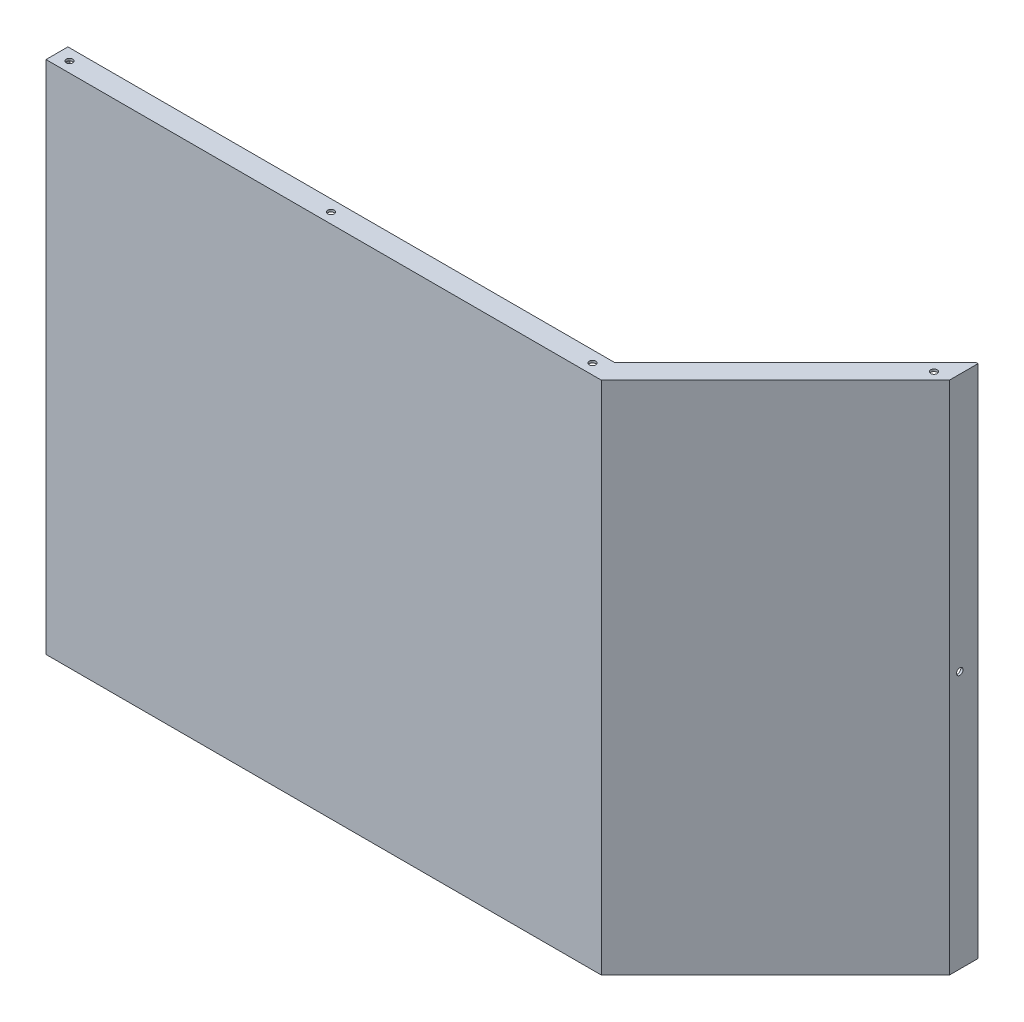
ISO-10303-21;
HEADER;
FILE_DESCRIPTION(('STEP AP214'),'2;1');
FILE_NAME('part.step','',(''),(''),'','','');
FILE_SCHEMA(('AUTOMOTIVE_DESIGN { 1 0 10303 214 1 1 1 1 }'));
ENDSEC;
DATA;
#1=APPLICATION_CONTEXT('core data for automotive mechanical design processes');
#2=APPLICATION_PROTOCOL_DEFINITION('international standard','automotive_design',2000,#1);
#3=PRODUCT_CONTEXT('',#1,'mechanical');
#4=PRODUCT('Part','Part','',(#3));
#5=PRODUCT_RELATED_PRODUCT_CATEGORY('part','',(#4));
#6=PRODUCT_DEFINITION_FORMATION('','',#4);
#7=PRODUCT_DEFINITION_CONTEXT('part definition',#1,'design');
#8=PRODUCT_DEFINITION('design','',#6,#7);
#9=PRODUCT_DEFINITION_SHAPE('','',#8);
#10=(LENGTH_UNIT() NAMED_UNIT(*) SI_UNIT(.MILLI.,.METRE.));
#11=(NAMED_UNIT(*) PLANE_ANGLE_UNIT() SI_UNIT($,.RADIAN.));
#12=(NAMED_UNIT(*) SI_UNIT($,.STERADIAN.) SOLID_ANGLE_UNIT());
#13=UNCERTAINTY_MEASURE_WITH_UNIT(LENGTH_MEASURE(1.E-05),#10,'distance_accuracy_value','');
#14=(GEOMETRIC_REPRESENTATION_CONTEXT(3) GLOBAL_UNCERTAINTY_ASSIGNED_CONTEXT((#13)) GLOBAL_UNIT_ASSIGNED_CONTEXT((#10,
#11,#12)) REPRESENTATION_CONTEXT('',''));
#15=CARTESIAN_POINT('',(0.,0.,0.));
#16=DIRECTION('',(0.,0.,1.));
#17=DIRECTION('',(1.,0.,0.));
#18=AXIS2_PLACEMENT_3D('',#15,#16,#17);
#19=CARTESIAN_POINT('',(-424.,197.,0.));
#20=DIRECTION('',(1.,0.,0.));
#21=DIRECTION('',(0.,0.,-1.));
#22=AXIS2_PLACEMENT_3D('',#19,#20,#21);
#23=PLANE('',#22);
#24=CARTESIAN_POINT('',(-424.,0.,-6.25));
#25=DIRECTION('',(-1.,0.,0.));
#26=DIRECTION('',(0.,0.,1.));
#27=AXIS2_PLACEMENT_3D('',#24,#25,#26);
#28=CIRCLE('',#27,2.5);
#29=CARTESIAN_POINT('',(-424.,0.,-3.75));
#30=VERTEX_POINT('',#29);
#31=EDGE_CURVE('E228',#30,#30,#28,.T.);
#32=ORIENTED_EDGE('',*,*,#31,.F.);
#33=EDGE_LOOP('',(#32));
#34=FACE_BOUND('',#33,.T.);
#35=DIRECTION('',(0.,0.,1.));
#36=VECTOR('',#35,1.);
#37=CARTESIAN_POINT('',(-424.,-197.,0.));
#38=LINE('',#37,#36);
#39=CARTESIAN_POINT('',(-424.,-197.,-15.));
#40=VERTEX_POINT('',#39);
#41=CARTESIAN_POINT('',(-424.,-197.,1.75));
#42=VERTEX_POINT('',#41);
#43=EDGE_CURVE('E299',#40,#42,#38,.T.);
#44=ORIENTED_EDGE('',*,*,#43,.T.);
#45=DIRECTION('',(0.,-1.,0.));
#46=VECTOR('',#45,1.);
#47=CARTESIAN_POINT('',(-424.,197.,1.75));
#48=LINE('',#47,#46);
#49=CARTESIAN_POINT('',(-424.,197.,1.75));
#50=VERTEX_POINT('',#49);
#51=EDGE_CURVE('E11',#50,#42,#48,.T.);
#52=ORIENTED_EDGE('',*,*,#51,.F.);
#53=DIRECTION('',(0.,0.,1.));
#54=VECTOR('',#53,1.);
#55=CARTESIAN_POINT('',(-424.,197.,0.));
#56=LINE('',#55,#54);
#57=CARTESIAN_POINT('',(-424.,197.,-15.));
#58=VERTEX_POINT('',#57);
#59=EDGE_CURVE('E300',#58,#50,#56,.T.);
#60=ORIENTED_EDGE('',*,*,#59,.F.);
#61=DIRECTION('',(0.,-1.,0.));
#62=VECTOR('',#61,1.);
#63=CARTESIAN_POINT('',(-424.,197.,-15.));
#64=LINE('',#63,#62);
#65=EDGE_CURVE('E174',#58,#40,#64,.T.);
#66=ORIENTED_EDGE('',*,*,#65,.T.);
#67=EDGE_LOOP('',(#44,#52,#60,#66));
#68=FACE_BOUND('',#67,.T.);
#69=ADVANCED_FACE('F37',(#34,#68),#23,.F.);
#70=CARTESIAN_POINT('',(-424.,197.,1.75));
#71=DIRECTION('',(0.,0.,-1.));
#72=DIRECTION('',(-1.,0.,0.));
#73=AXIS2_PLACEMENT_3D('',#70,#71,#72);
#74=PLANE('',#73);
#75=DIRECTION('',(1.,0.,0.));
#76=VECTOR('',#75,1.);
#77=CARTESIAN_POINT('',(-424.,-197.,1.75));
#78=LINE('',#77,#76);
#79=CARTESIAN_POINT('',(0.724873734152892,-197.,1.75));
#80=VERTEX_POINT('',#79);
#81=EDGE_CURVE('E314',#42,#80,#78,.T.);
#82=ORIENTED_EDGE('',*,*,#81,.T.);
#83=DIRECTION('',(0.,-1.,0.));
#84=VECTOR('',#83,1.);
#85=CARTESIAN_POINT('',(0.724873734152892,197.,1.75));
#86=LINE('',#85,#84);
#87=CARTESIAN_POINT('',(0.724873734152892,197.,1.75));
#88=VERTEX_POINT('',#87);
#89=EDGE_CURVE('E45',#88,#80,#86,.T.);
#90=ORIENTED_EDGE('',*,*,#89,.F.);
#91=DIRECTION('',(1.,0.,0.));
#92=VECTOR('',#91,1.);
#93=CARTESIAN_POINT('',(-424.,197.,1.75));
#94=LINE('',#93,#92);
#95=EDGE_CURVE('E302',#50,#88,#94,.T.);
#96=ORIENTED_EDGE('',*,*,#95,.F.);
#97=ORIENTED_EDGE('',*,*,#51,.T.);
#98=EDGE_LOOP('',(#82,#90,#96,#97));
#99=FACE_BOUND('',#98,.T.);
#100=ADVANCED_FACE('F370',(#99),#74,.F.);
#101=CARTESIAN_POINT('',(133.75,197.,-131.275126265848));
#102=DIRECTION('',(-0.707106781186549,0.,-0.707106781186546));
#103=DIRECTION('',(-0.707106781186546,0.,0.707106781186549));
#104=AXIS2_PLACEMENT_3D('',#101,#102,#103);
#105=PLANE('',#104);
#106=DIRECTION('',(0.707106781186546,0.,-0.707106781186549));
#107=VECTOR('',#106,1.);
#108=CARTESIAN_POINT('',(133.75,-197.,-131.275126265848));
#109=LINE('',#108,#107);
#110=CARTESIAN_POINT('',(133.75,-197.,-131.275126265848));
#111=VERTEX_POINT('',#110);
#112=EDGE_CURVE('E316',#80,#111,#109,.T.);
#113=ORIENTED_EDGE('',*,*,#112,.T.);
#114=DIRECTION('',(0.,-1.,0.));
#115=VECTOR('',#114,1.);
#116=CARTESIAN_POINT('',(133.75,197.,-131.275126265848));
#117=LINE('',#116,#115);
#118=CARTESIAN_POINT('',(133.75,197.,-131.275126265848));
#119=VERTEX_POINT('',#118);
#120=EDGE_CURVE('E190',#119,#111,#117,.T.);
#121=ORIENTED_EDGE('',*,*,#120,.F.);
#122=DIRECTION('',(0.707106781186546,0.,-0.707106781186549));
#123=VECTOR('',#122,1.);
#124=CARTESIAN_POINT('',(133.75,197.,-131.275126265848));
#125=LINE('',#124,#123);
#126=EDGE_CURVE('E305',#88,#119,#125,.T.);
#127=ORIENTED_EDGE('',*,*,#126,.F.);
#128=ORIENTED_EDGE('',*,*,#89,.T.);
#129=EDGE_LOOP('',(#113,#121,#127,#128));
#130=FACE_BOUND('',#129,.T.);
#131=ADVANCED_FACE('F375',(#130),#105,.F.);
#132=CARTESIAN_POINT('',(133.75,197.,-153.2));
#133=DIRECTION('',(-1.,0.,0.));
#134=DIRECTION('',(0.,0.,1.));
#135=AXIS2_PLACEMENT_3D('',#132,#133,#134);
#136=PLANE('',#135);
#137=CARTESIAN_POINT('',(133.75,0.,-139.275126265848));
#138=DIRECTION('',(1.,0.,0.));
#139=DIRECTION('',(0.,0.,-1.));
#140=AXIS2_PLACEMENT_3D('',#137,#138,#139);
#141=CIRCLE('',#140,2.5);
#142=CARTESIAN_POINT('',(133.75,0.,-141.775126265848));
#143=VERTEX_POINT('',#142);
#144=EDGE_CURVE('E217',#143,#143,#141,.T.);
#145=ORIENTED_EDGE('',*,*,#144,.F.);
#146=EDGE_LOOP('',(#145));
#147=FACE_BOUND('',#146,.T.);
#148=DIRECTION('',(0.,0.,-1.));
#149=VECTOR('',#148,1.);
#150=CARTESIAN_POINT('',(133.75,-197.,-153.2));
#151=LINE('',#150,#149);
#152=CARTESIAN_POINT('',(133.75,-197.,-153.2));
#153=VERTEX_POINT('',#152);
#154=EDGE_CURVE('E318',#111,#153,#151,.T.);
#155=ORIENTED_EDGE('',*,*,#154,.T.);
#156=DIRECTION('',(0.,-1.,0.));
#157=VECTOR('',#156,1.);
#158=CARTESIAN_POINT('',(133.75,197.,-153.2));
#159=LINE('',#158,#157);
#160=CARTESIAN_POINT('',(133.75,197.,-153.2));
#161=VERTEX_POINT('',#160);
#162=EDGE_CURVE('E187',#161,#153,#159,.T.);
#163=ORIENTED_EDGE('',*,*,#162,.F.);
#164=DIRECTION('',(0.,0.,-1.));
#165=VECTOR('',#164,1.);
#166=CARTESIAN_POINT('',(133.75,197.,-153.2));
#167=LINE('',#166,#165);
#168=EDGE_CURVE('E307',#119,#161,#167,.T.);
#169=ORIENTED_EDGE('',*,*,#168,.F.);
#170=ORIENTED_EDGE('',*,*,#120,.T.);
#171=EDGE_LOOP('',(#155,#163,#169,#170));
#172=FACE_BOUND('',#171,.T.);
#173=ADVANCED_FACE('F483',(#147,#172),#136,.F.);
#174=CARTESIAN_POINT('',(132.,197.,-153.200000000001));
#175=DIRECTION('',(0.,0.,1.));
#176=DIRECTION('',(1.,0.,0.));
#177=AXIS2_PLACEMENT_3D('',#174,#175,#176);
#178=PLANE('',#177);
#179=DIRECTION('',(-1.,0.,0.));
#180=VECTOR('',#179,1.);
#181=CARTESIAN_POINT('',(132.,-197.,-153.200000000001));
#182=LINE('',#181,#180);
#183=CARTESIAN_POINT('',(132.,-197.,-153.200000000001));
#184=VERTEX_POINT('',#183);
#185=EDGE_CURVE('E320',#153,#184,#182,.T.);
#186=ORIENTED_EDGE('',*,*,#185,.T.);
#187=DIRECTION('',(0.,1.,0.));
#188=VECTOR('',#187,1.);
#189=CARTESIAN_POINT('',(132.,197.,-153.200000000001));
#190=LINE('',#189,#188);
#191=CARTESIAN_POINT('',(132.,-195.25,-153.200000000001));
#192=VERTEX_POINT('',#191);
#193=EDGE_CURVE('E295',#184,#192,#190,.T.);
#194=ORIENTED_EDGE('',*,*,#193,.T.);
#195=DIRECTION('',(0.,-1.,0.));
#196=VECTOR('',#195,1.);
#197=CARTESIAN_POINT('',(132.,197.,-153.200000000001));
#198=LINE('',#197,#196);
#199=CARTESIAN_POINT('',(132.,195.25,-153.200000000001));
#200=VERTEX_POINT('',#199);
#201=EDGE_CURVE('E53',#200,#192,#198,.T.);
#202=ORIENTED_EDGE('',*,*,#201,.F.);
#203=CARTESIAN_POINT('',(132.,197.,-153.200000000001));
#204=VERTEX_POINT('',#203);
#205=EDGE_CURVE('E185',#204,#200,#198,.T.);
#206=ORIENTED_EDGE('',*,*,#205,.F.);
#207=DIRECTION('',(-1.,0.,0.));
#208=VECTOR('',#207,1.);
#209=CARTESIAN_POINT('',(132.,197.,-153.200000000001));
#210=LINE('',#209,#208);
#211=EDGE_CURVE('E309',#161,#204,#210,.T.);
#212=ORIENTED_EDGE('',*,*,#211,.F.);
#213=ORIENTED_EDGE('',*,*,#162,.T.);
#214=EDGE_LOOP('',(#186,#194,#202,#206,#212,#213));
#215=FACE_BOUND('',#214,.T.);
#216=ADVANCED_FACE('F341',(#215),#178,.F.);
#217=CARTESIAN_POINT('',(132.,197.,-132.000000000001));
#218=DIRECTION('',(1.,0.,0.));
#219=DIRECTION('',(0.,0.,-1.));
#220=AXIS2_PLACEMENT_3D('',#217,#218,#219);
#221=PLANE('',#220);
#222=CARTESIAN_POINT('',(132.,0.,-139.275126265848));
#223=DIRECTION('',(1.,0.,0.));
#224=DIRECTION('',(0.,0.,-1.));
#225=AXIS2_PLACEMENT_3D('',#222,#223,#224);
#226=CIRCLE('',#225,2.5);
#227=CARTESIAN_POINT('',(132.,0.,-141.775126265848));
#228=VERTEX_POINT('',#227);
#229=EDGE_CURVE('E214',#228,#228,#226,.T.);
#230=ORIENTED_EDGE('',*,*,#229,.T.);
#231=EDGE_LOOP('',(#230));
#232=FACE_BOUND('',#231,.T.);
#233=DIRECTION('',(0.,-1.,0.));
#234=VECTOR('',#233,1.);
#235=CARTESIAN_POINT('',(132.,197.,-132.000000000001));
#236=LINE('',#235,#234);
#237=CARTESIAN_POINT('',(132.,195.25,-132.000000000001));
#238=VERTEX_POINT('',#237);
#239=CARTESIAN_POINT('',(132.,-195.25,-132.000000000001));
#240=VERTEX_POINT('',#239);
#241=EDGE_CURVE('E61',#238,#240,#236,.T.);
#242=ORIENTED_EDGE('',*,*,#241,.F.);
#243=DIRECTION('',(0.,0.,1.));
#244=VECTOR('',#243,1.);
#245=CARTESIAN_POINT('',(132.,195.25,-132.000000000001));
#246=LINE('',#245,#244);
#247=EDGE_CURVE('E259',#200,#238,#246,.T.);
#248=ORIENTED_EDGE('',*,*,#247,.F.);
#249=ORIENTED_EDGE('',*,*,#201,.T.);
#250=DIRECTION('',(0.,0.,1.));
#251=VECTOR('',#250,1.);
#252=CARTESIAN_POINT('',(132.,-195.25,-132.000000000001));
#253=LINE('',#252,#251);
#254=EDGE_CURVE('E278',#192,#240,#253,.T.);
#255=ORIENTED_EDGE('',*,*,#254,.T.);
#256=EDGE_LOOP('',(#242,#248,#249,#255));
#257=FACE_BOUND('',#256,.T.);
#258=ADVANCED_FACE('F338',(#232,#257),#221,.F.);
#259=CARTESIAN_POINT('',(0.,197.,0.));
#260=DIRECTION('',(0.707106781186549,0.,0.707106781186546));
#261=DIRECTION('',(0.707106781186546,0.,-0.707106781186549));
#262=AXIS2_PLACEMENT_3D('',#259,#260,#261);
#263=PLANE('',#262);
#264=DIRECTION('',(0.,-1.,0.));
#265=VECTOR('',#264,1.);
#266=CARTESIAN_POINT('',(0.,197.,0.));
#267=LINE('',#266,#265);
#268=CARTESIAN_POINT('',(0.,195.25,0.));
#269=VERTEX_POINT('',#268);
#270=CARTESIAN_POINT('',(0.,-195.25,0.));
#271=VERTEX_POINT('',#270);
#272=EDGE_CURVE('E176',#269,#271,#267,.T.);
#273=ORIENTED_EDGE('',*,*,#272,.F.);
#274=DIRECTION('',(-0.707106781186546,0.,0.707106781186549));
#275=VECTOR('',#274,1.);
#276=CARTESIAN_POINT('',(0.,195.25,0.));
#277=LINE('',#276,#275);
#278=EDGE_CURVE('E257',#238,#269,#277,.T.);
#279=ORIENTED_EDGE('',*,*,#278,.F.);
#280=ORIENTED_EDGE('',*,*,#241,.T.);
#281=DIRECTION('',(-0.707106781186546,0.,0.707106781186549));
#282=VECTOR('',#281,1.);
#283=CARTESIAN_POINT('',(0.,-195.25,0.));
#284=LINE('',#283,#282);
#285=EDGE_CURVE('E282',#240,#271,#284,.T.);
#286=ORIENTED_EDGE('',*,*,#285,.T.);
#287=EDGE_LOOP('',(#273,#279,#280,#286));
#288=FACE_BOUND('',#287,.T.);
#289=ADVANCED_FACE('F360',(#288),#263,.F.);
#290=CARTESIAN_POINT('',(-422.25,197.,0.));
#291=DIRECTION('',(0.,0.,1.));
#292=DIRECTION('',(1.,0.,0.));
#293=AXIS2_PLACEMENT_3D('',#290,#291,#292);
#294=PLANE('',#293);
#295=DIRECTION('',(0.,-1.,0.));
#296=VECTOR('',#295,1.);
#297=CARTESIAN_POINT('',(-422.25,197.,0.));
#298=LINE('',#297,#296);
#299=CARTESIAN_POINT('',(-422.25,195.25,0.));
#300=VERTEX_POINT('',#299);
#301=CARTESIAN_POINT('',(-422.25,-195.25,0.));
#302=VERTEX_POINT('',#301);
#303=EDGE_CURVE('E173',#300,#302,#298,.T.);
#304=ORIENTED_EDGE('',*,*,#303,.F.);
#305=DIRECTION('',(-1.,0.,0.));
#306=VECTOR('',#305,1.);
#307=CARTESIAN_POINT('',(-422.25,195.25,0.));
#308=LINE('',#307,#306);
#309=EDGE_CURVE('E154',#269,#300,#308,.T.);
#310=ORIENTED_EDGE('',*,*,#309,.F.);
#311=ORIENTED_EDGE('',*,*,#272,.T.);
#312=DIRECTION('',(-1.,0.,0.));
#313=VECTOR('',#312,1.);
#314=CARTESIAN_POINT('',(-422.25,-195.25,0.));
#315=LINE('',#314,#313);
#316=EDGE_CURVE('E284',#271,#302,#315,.T.);
#317=ORIENTED_EDGE('',*,*,#316,.T.);
#318=EDGE_LOOP('',(#304,#310,#311,#317));
#319=FACE_BOUND('',#318,.T.);
#320=ADVANCED_FACE('F358',(#319),#294,.F.);
#321=CARTESIAN_POINT('',(-422.25,197.,-15.));
#322=DIRECTION('',(-1.,0.,0.));
#323=DIRECTION('',(0.,0.,1.));
#324=AXIS2_PLACEMENT_3D('',#321,#322,#323);
#325=PLANE('',#324);
#326=CARTESIAN_POINT('',(-422.25,0.,-6.25));
#327=DIRECTION('',(-1.,0.,0.));
#328=DIRECTION('',(0.,0.,1.));
#329=AXIS2_PLACEMENT_3D('',#326,#327,#328);
#330=CIRCLE('',#329,2.5);
#331=CARTESIAN_POINT('',(-422.25,0.,-3.75));
#332=VERTEX_POINT('',#331);
#333=EDGE_CURVE('E40',#332,#332,#330,.T.);
#334=ORIENTED_EDGE('',*,*,#333,.T.);
#335=EDGE_LOOP('',(#334));
#336=FACE_BOUND('',#335,.T.);
#337=DIRECTION('',(0.,-1.,0.));
#338=VECTOR('',#337,1.);
#339=CARTESIAN_POINT('',(-422.25,197.,-15.));
#340=LINE('',#339,#338);
#341=CARTESIAN_POINT('',(-422.25,195.25,-15.));
#342=VERTEX_POINT('',#341);
#343=CARTESIAN_POINT('',(-422.25,-195.25,-15.));
#344=VERTEX_POINT('',#343);
#345=EDGE_CURVE('E163',#342,#344,#340,.T.);
#346=ORIENTED_EDGE('',*,*,#345,.F.);
#347=DIRECTION('',(0.,0.,-1.));
#348=VECTOR('',#347,1.);
#349=CARTESIAN_POINT('',(-422.25,195.25,-15.));
#350=LINE('',#349,#348);
#351=EDGE_CURVE('E148',#300,#342,#350,.T.);
#352=ORIENTED_EDGE('',*,*,#351,.F.);
#353=ORIENTED_EDGE('',*,*,#303,.T.);
#354=DIRECTION('',(0.,0.,-1.));
#355=VECTOR('',#354,1.);
#356=CARTESIAN_POINT('',(-422.25,-195.25,-15.));
#357=LINE('',#356,#355);
#358=EDGE_CURVE('E171',#302,#344,#357,.T.);
#359=ORIENTED_EDGE('',*,*,#358,.T.);
#360=EDGE_LOOP('',(#346,#352,#353,#359));
#361=FACE_BOUND('',#360,.T.);
#362=ADVANCED_FACE('F169',(#336,#361),#325,.F.);
#363=CARTESIAN_POINT('',(-424.,197.,-15.));
#364=DIRECTION('',(0.,0.,1.));
#365=DIRECTION('',(1.,0.,0.));
#366=AXIS2_PLACEMENT_3D('',#363,#364,#365);
#367=PLANE('',#366);
#368=DIRECTION('',(-1.,0.,0.));
#369=VECTOR('',#368,1.);
#370=CARTESIAN_POINT('',(-424.,-197.,-15.));
#371=LINE('',#370,#369);
#372=CARTESIAN_POINT('',(-6.21320343559645,-197.,-15.));
#373=VERTEX_POINT('',#372);
#374=EDGE_CURVE('E303',#373,#40,#371,.T.);
#375=ORIENTED_EDGE('',*,*,#374,.T.);
#376=ORIENTED_EDGE('',*,*,#65,.F.);
#377=DIRECTION('',(-1.,0.,0.));
#378=VECTOR('',#377,1.);
#379=CARTESIAN_POINT('',(-424.,197.,-15.));
#380=LINE('',#379,#378);
#381=CARTESIAN_POINT('',(-6.21320343559645,197.,-15.));
#382=VERTEX_POINT('',#381);
#383=EDGE_CURVE('E179',#382,#58,#380,.T.);
#384=ORIENTED_EDGE('',*,*,#383,.F.);
#385=DIRECTION('',(0.,1.,0.));
#386=VECTOR('',#385,1.);
#387=CARTESIAN_POINT('',(-6.21320343559645,195.25,-15.));
#388=LINE('',#387,#386);
#389=CARTESIAN_POINT('',(-6.21320343559645,195.25,-15.));
#390=VERTEX_POINT('',#389);
#391=EDGE_CURVE('E166',#390,#382,#388,.T.);
#392=ORIENTED_EDGE('',*,*,#391,.F.);
#393=DIRECTION('',(1.,0.,0.));
#394=VECTOR('',#393,1.);
#395=CARTESIAN_POINT('',(-422.25,195.25,-15.));
#396=LINE('',#395,#394);
#397=EDGE_CURVE('E151',#342,#390,#396,.T.);
#398=ORIENTED_EDGE('',*,*,#397,.F.);
#399=ORIENTED_EDGE('',*,*,#345,.T.);
#400=DIRECTION('',(1.,0.,0.));
#401=VECTOR('',#400,1.);
#402=CARTESIAN_POINT('',(-422.25,-195.25,-15.));
#403=LINE('',#402,#401);
#404=CARTESIAN_POINT('',(-6.21320343559645,-195.25,-15.));
#405=VERTEX_POINT('',#404);
#406=EDGE_CURVE('E272',#344,#405,#403,.T.);
#407=ORIENTED_EDGE('',*,*,#406,.T.);
#408=DIRECTION('',(0.,-1.,0.));
#409=VECTOR('',#408,1.);
#410=CARTESIAN_POINT('',(-6.21320343559645,-195.25,-15.));
#411=LINE('',#410,#409);
#412=EDGE_CURVE('E288',#405,#373,#411,.T.);
#413=ORIENTED_EDGE('',*,*,#412,.T.);
#414=EDGE_LOOP('',(#375,#376,#384,#392,#398,#399,#407,#413));
#415=FACE_BOUND('',#414,.T.);
#416=ADVANCED_FACE('F161',(#415),#367,.F.);
#417=CARTESIAN_POINT('',(0.,197.,0.));
#418=DIRECTION('',(0.,-1.,0.));
#419=DIRECTION('',(0.,0.,-1.));
#420=AXIS2_PLACEMENT_3D('',#417,#418,#419);
#421=PLANE('',#420);
#422=CARTESIAN_POINT('',(-414.,197.,-6.25));
#423=DIRECTION('',(0.,-1.,0.));
#424=DIRECTION('',(0.,0.,-1.));
#425=AXIS2_PLACEMENT_3D('',#422,#423,#424);
#426=CIRCLE('',#425,2.50000000000002);
#427=CARTESIAN_POINT('',(-414.,197.,-8.75000000000002));
#428=VERTEX_POINT('',#427);
#429=EDGE_CURVE('E252',#428,#428,#426,.T.);
#430=ORIENTED_EDGE('',*,*,#429,.T.);
#431=EDGE_LOOP('',(#430));
#432=FACE_BOUND('',#431,.T.);
#433=CARTESIAN_POINT('',(-214.,197.,-6.25));
#434=DIRECTION('',(0.,-1.,0.));
#435=DIRECTION('',(0.,0.,-1.));
#436=AXIS2_PLACEMENT_3D('',#433,#434,#435);
#437=CIRCLE('',#436,2.5);
#438=CARTESIAN_POINT('',(-214.,197.,-8.75));
#439=VERTEX_POINT('',#438);
#440=EDGE_CURVE('E213',#439,#439,#437,.T.);
#441=ORIENTED_EDGE('',*,*,#440,.T.);
#442=EDGE_LOOP('',(#441));
#443=FACE_BOUND('',#442,.T.);
#444=CARTESIAN_POINT('',(-14.,197.,-6.25));
#445=DIRECTION('',(0.,-1.,0.));
#446=DIRECTION('',(0.,0.,-1.));
#447=AXIS2_PLACEMENT_3D('',#444,#445,#446);
#448=CIRCLE('',#447,2.5);
#449=CARTESIAN_POINT('',(-14.,197.,-8.75));
#450=VERTEX_POINT('',#449);
#451=EDGE_CURVE('E209',#450,#450,#448,.T.);
#452=ORIENTED_EDGE('',*,*,#451,.T.);
#453=EDGE_LOOP('',(#452));
#454=FACE_BOUND('',#453,.T.);
#455=CARTESIAN_POINT('',(122.221470086679,197.,-131.060304851511));
#456=DIRECTION('',(0.,-1.,0.));
#457=DIRECTION('',(0.,0.,-1.));
#458=AXIS2_PLACEMENT_3D('',#455,#456,#457);
#459=CIRCLE('',#458,2.5);
#460=CARTESIAN_POINT('',(122.221470086679,197.,-133.560304851511));
#461=VERTEX_POINT('',#460);
#462=EDGE_CURVE('E204',#461,#461,#459,.T.);
#463=ORIENTED_EDGE('',*,*,#462,.T.);
#464=EDGE_LOOP('',(#463));
#465=FACE_BOUND('',#464,.T.);
#466=ORIENTED_EDGE('',*,*,#59,.T.);
#467=ORIENTED_EDGE('',*,*,#95,.T.);
#468=ORIENTED_EDGE('',*,*,#126,.T.);
#469=ORIENTED_EDGE('',*,*,#168,.T.);
#470=ORIENTED_EDGE('',*,*,#211,.T.);
#471=DIRECTION('',(0.,0.,1.));
#472=VECTOR('',#471,1.);
#473=CARTESIAN_POINT('',(132.,197.,-132.000000000001));
#474=LINE('',#473,#472);
#475=CARTESIAN_POINT('',(132.,197.,-153.213203435597));
#476=VERTEX_POINT('',#475);
#477=EDGE_CURVE('E254',#476,#204,#474,.T.);
#478=ORIENTED_EDGE('',*,*,#477,.F.);
#479=DIRECTION('',(0.707106781186546,0.,-0.707106781186549));
#480=VECTOR('',#479,1.);
#481=CARTESIAN_POINT('',(-6.21320343559645,197.,-15.));
#482=LINE('',#481,#480);
#483=EDGE_CURVE('E167',#382,#476,#482,.T.);
#484=ORIENTED_EDGE('',*,*,#483,.F.);
#485=ORIENTED_EDGE('',*,*,#383,.T.);
#486=EDGE_LOOP('',(#466,#467,#468,#469,#470,#478,#484,#485));
#487=FACE_BOUND('',#486,.T.);
#488=ADVANCED_FACE('F329',(#432,#443,#454,#465,#487),#421,.F.);
#489=CARTESIAN_POINT('',(0.,-197.,0.));
#490=DIRECTION('',(0.,-1.,0.));
#491=DIRECTION('',(0.,0.,-1.));
#492=AXIS2_PLACEMENT_3D('',#489,#490,#491);
#493=PLANE('',#492);
#494=CARTESIAN_POINT('',(-414.,-197.,-6.25));
#495=DIRECTION('',(0.,-1.,0.));
#496=DIRECTION('',(0.,0.,-1.));
#497=AXIS2_PLACEMENT_3D('',#494,#495,#496);
#498=CIRCLE('',#497,2.50000000000002);
#499=CARTESIAN_POINT('',(-414.,-197.,-8.75000000000002));
#500=VERTEX_POINT('',#499);
#501=EDGE_CURVE('E199',#500,#500,#498,.T.);
#502=ORIENTED_EDGE('',*,*,#501,.F.);
#503=EDGE_LOOP('',(#502));
#504=FACE_BOUND('',#503,.T.);
#505=CARTESIAN_POINT('',(-214.,-197.,-6.25));
#506=DIRECTION('',(0.,-1.,0.));
#507=DIRECTION('',(0.,0.,-1.));
#508=AXIS2_PLACEMENT_3D('',#505,#506,#507);
#509=CIRCLE('',#508,2.5);
#510=CARTESIAN_POINT('',(-214.,-197.,-8.75));
#511=VERTEX_POINT('',#510);
#512=EDGE_CURVE('E233',#511,#511,#509,.T.);
#513=ORIENTED_EDGE('',*,*,#512,.F.);
#514=EDGE_LOOP('',(#513));
#515=FACE_BOUND('',#514,.T.);
#516=CARTESIAN_POINT('',(-14.,-197.,-6.25));
#517=DIRECTION('',(0.,-1.,0.));
#518=DIRECTION('',(0.,0.,-1.));
#519=AXIS2_PLACEMENT_3D('',#516,#517,#518);
#520=CIRCLE('',#519,2.5);
#521=CARTESIAN_POINT('',(-14.,-197.,-8.75));
#522=VERTEX_POINT('',#521);
#523=EDGE_CURVE('E221',#522,#522,#520,.T.);
#524=ORIENTED_EDGE('',*,*,#523,.F.);
#525=EDGE_LOOP('',(#524));
#526=FACE_BOUND('',#525,.T.);
#527=CARTESIAN_POINT('',(122.221470086679,-197.,-131.060304851511));
#528=DIRECTION('',(0.,-1.,0.));
#529=DIRECTION('',(0.,0.,-1.));
#530=AXIS2_PLACEMENT_3D('',#527,#528,#529);
#531=CIRCLE('',#530,2.5);
#532=CARTESIAN_POINT('',(122.221470086679,-197.,-133.560304851511));
#533=VERTEX_POINT('',#532);
#534=EDGE_CURVE('E216',#533,#533,#531,.T.);
#535=ORIENTED_EDGE('',*,*,#534,.F.);
#536=EDGE_LOOP('',(#535));
#537=FACE_BOUND('',#536,.T.);
#538=ORIENTED_EDGE('',*,*,#374,.F.);
#539=DIRECTION('',(0.707106781186546,0.,-0.707106781186549));
#540=VECTOR('',#539,1.);
#541=CARTESIAN_POINT('',(-6.21320343559645,-197.,-15.));
#542=LINE('',#541,#540);
#543=CARTESIAN_POINT('',(132.,-197.,-153.213203435597));
#544=VERTEX_POINT('',#543);
#545=EDGE_CURVE('E269',#373,#544,#542,.T.);
#546=ORIENTED_EDGE('',*,*,#545,.T.);
#547=DIRECTION('',(0.,0.,1.));
#548=VECTOR('',#547,1.);
#549=CARTESIAN_POINT('',(132.,-197.,-132.000000000001));
#550=LINE('',#549,#548);
#551=EDGE_CURVE('E275',#544,#184,#550,.T.);
#552=ORIENTED_EDGE('',*,*,#551,.T.);
#553=ORIENTED_EDGE('',*,*,#185,.F.);
#554=ORIENTED_EDGE('',*,*,#154,.F.);
#555=ORIENTED_EDGE('',*,*,#112,.F.);
#556=ORIENTED_EDGE('',*,*,#81,.F.);
#557=ORIENTED_EDGE('',*,*,#43,.F.);
#558=EDGE_LOOP('',(#538,#546,#552,#553,#554,#555,#556,#557));
#559=FACE_BOUND('',#558,.T.);
#560=ADVANCED_FACE('F394',(#504,#515,#526,#537,#559),#493,.T.);
#561=CARTESIAN_POINT('',(132.,-195.25,-132.000000000001));
#562=DIRECTION('',(1.,0.,0.));
#563=DIRECTION('',(0.,0.,-1.));
#564=AXIS2_PLACEMENT_3D('',#561,#562,#563);
#565=PLANE('',#564);
#566=ORIENTED_EDGE('',*,*,#193,.F.);
#567=ORIENTED_EDGE('',*,*,#551,.F.);
#568=DIRECTION('',(0.,-1.,0.));
#569=VECTOR('',#568,1.);
#570=CARTESIAN_POINT('',(132.,-195.25,-153.213203435597));
#571=LINE('',#570,#569);
#572=CARTESIAN_POINT('',(132.,-195.25,-153.213203435597));
#573=VERTEX_POINT('',#572);
#574=EDGE_CURVE('E293',#573,#544,#571,.T.);
#575=ORIENTED_EDGE('',*,*,#574,.F.);
#576=EDGE_CURVE('E279',#573,#192,#253,.T.);
#577=ORIENTED_EDGE('',*,*,#576,.T.);
#578=EDGE_LOOP('',(#566,#567,#575,#577));
#579=FACE_BOUND('',#578,.T.);
#580=ADVANCED_FACE('F354',(#579),#565,.T.);
#581=CARTESIAN_POINT('',(-6.21320343559645,-195.25,-15.));
#582=DIRECTION('',(-0.707106781186549,0.,-0.707106781186546));
#583=DIRECTION('',(-0.707106781186546,0.,0.707106781186549));
#584=AXIS2_PLACEMENT_3D('',#581,#582,#583);
#585=PLANE('',#584);
#586=ORIENTED_EDGE('',*,*,#545,.F.);
#587=ORIENTED_EDGE('',*,*,#412,.F.);
#588=DIRECTION('',(0.707106781186546,0.,-0.707106781186549));
#589=VECTOR('',#588,1.);
#590=CARTESIAN_POINT('',(-6.21320343559645,-195.25,-15.));
#591=LINE('',#590,#589);
#592=EDGE_CURVE('E274',#405,#573,#591,.T.);
#593=ORIENTED_EDGE('',*,*,#592,.T.);
#594=ORIENTED_EDGE('',*,*,#574,.T.);
#595=EDGE_LOOP('',(#586,#587,#593,#594));
#596=FACE_BOUND('',#595,.T.);
#597=ADVANCED_FACE('F356',(#596),#585,.T.);
#598=CARTESIAN_POINT('',(0.,-195.25,0.));
#599=DIRECTION('',(0.,1.,0.));
#600=DIRECTION('',(0.,0.,1.));
#601=AXIS2_PLACEMENT_3D('',#598,#599,#600);
#602=PLANE('',#601);
#603=CARTESIAN_POINT('',(-414.,-195.25,-6.25));
#604=DIRECTION('',(0.,1.,0.));
#605=DIRECTION('',(0.,0.,1.));
#606=AXIS2_PLACEMENT_3D('',#603,#604,#605);
#607=CIRCLE('',#606,2.50000000000002);
#608=CARTESIAN_POINT('',(-414.,-195.25,-3.74999999999998));
#609=VERTEX_POINT('',#608);
#610=EDGE_CURVE('E212',#609,#609,#607,.T.);
#611=ORIENTED_EDGE('',*,*,#610,.F.);
#612=EDGE_LOOP('',(#611));
#613=FACE_BOUND('',#612,.T.);
#614=CARTESIAN_POINT('',(-214.,-195.25,-6.25));
#615=DIRECTION('',(0.,1.,0.));
#616=DIRECTION('',(0.,0.,1.));
#617=AXIS2_PLACEMENT_3D('',#614,#615,#616);
#618=CIRCLE('',#617,2.5);
#619=CARTESIAN_POINT('',(-214.,-195.25,-3.75));
#620=VERTEX_POINT('',#619);
#621=EDGE_CURVE('E208',#620,#620,#618,.T.);
#622=ORIENTED_EDGE('',*,*,#621,.F.);
#623=EDGE_LOOP('',(#622));
#624=FACE_BOUND('',#623,.T.);
#625=CARTESIAN_POINT('',(-14.,-195.25,-6.25));
#626=DIRECTION('',(0.,1.,0.));
#627=DIRECTION('',(0.,0.,1.));
#628=AXIS2_PLACEMENT_3D('',#625,#626,#627);
#629=CIRCLE('',#628,2.5);
#630=CARTESIAN_POINT('',(-14.,-195.25,-3.75));
#631=VERTEX_POINT('',#630);
#632=EDGE_CURVE('E203',#631,#631,#629,.T.);
#633=ORIENTED_EDGE('',*,*,#632,.F.);
#634=EDGE_LOOP('',(#633));
#635=FACE_BOUND('',#634,.T.);
#636=CARTESIAN_POINT('',(122.221470086679,-195.25,-131.060304851511));
#637=DIRECTION('',(0.,1.,0.));
#638=DIRECTION('',(0.,0.,1.));
#639=AXIS2_PLACEMENT_3D('',#636,#637,#638);
#640=CIRCLE('',#639,2.5);
#641=CARTESIAN_POINT('',(122.221470086679,-195.25,-128.560304851511));
#642=VERTEX_POINT('',#641);
#643=EDGE_CURVE('E198',#642,#642,#640,.T.);
#644=ORIENTED_EDGE('',*,*,#643,.F.);
#645=EDGE_LOOP('',(#644));
#646=FACE_BOUND('',#645,.T.);
#647=ORIENTED_EDGE('',*,*,#406,.F.);
#648=ORIENTED_EDGE('',*,*,#358,.F.);
#649=ORIENTED_EDGE('',*,*,#316,.F.);
#650=ORIENTED_EDGE('',*,*,#285,.F.);
#651=ORIENTED_EDGE('',*,*,#254,.F.);
#652=ORIENTED_EDGE('',*,*,#576,.F.);
#653=ORIENTED_EDGE('',*,*,#592,.F.);
#654=EDGE_LOOP('',(#647,#648,#649,#650,#651,#652,#653));
#655=FACE_BOUND('',#654,.T.);
#656=ADVANCED_FACE('F351',(#613,#624,#635,#646,#655),#602,.T.);
#657=CARTESIAN_POINT('',(132.,195.25,-132.000000000001));
#658=DIRECTION('',(-1.,0.,0.));
#659=DIRECTION('',(0.,0.,1.));
#660=AXIS2_PLACEMENT_3D('',#657,#658,#659);
#661=PLANE('',#660);
#662=ORIENTED_EDGE('',*,*,#477,.T.);
#663=ORIENTED_EDGE('',*,*,#205,.T.);
#664=CARTESIAN_POINT('',(132.,195.25,-153.213203435597));
#665=VERTEX_POINT('',#664);
#666=EDGE_CURVE('E260',#665,#200,#246,.T.);
#667=ORIENTED_EDGE('',*,*,#666,.F.);
#668=DIRECTION('',(0.,1.,0.));
#669=VECTOR('',#668,1.);
#670=CARTESIAN_POINT('',(132.,195.25,-153.213203435597));
#671=LINE('',#670,#669);
#672=EDGE_CURVE('E265',#665,#476,#671,.T.);
#673=ORIENTED_EDGE('',*,*,#672,.T.);
#674=EDGE_LOOP('',(#662,#663,#667,#673));
#675=FACE_BOUND('',#674,.T.);
#676=ADVANCED_FACE('F407',(#675),#661,.F.);
#677=CARTESIAN_POINT('',(-6.21320343559645,195.25,-15.));
#678=DIRECTION('',(0.707106781186549,0.,0.707106781186546));
#679=DIRECTION('',(0.707106781186546,0.,-0.707106781186549));
#680=AXIS2_PLACEMENT_3D('',#677,#678,#679);
#681=PLANE('',#680);
#682=ORIENTED_EDGE('',*,*,#483,.T.);
#683=ORIENTED_EDGE('',*,*,#672,.F.);
#684=DIRECTION('',(0.707106781186546,0.,-0.707106781186549));
#685=VECTOR('',#684,1.);
#686=CARTESIAN_POINT('',(-6.21320343559645,195.25,-15.));
#687=LINE('',#686,#685);
#688=EDGE_CURVE('E263',#390,#665,#687,.T.);
#689=ORIENTED_EDGE('',*,*,#688,.F.);
#690=ORIENTED_EDGE('',*,*,#391,.T.);
#691=EDGE_LOOP('',(#682,#683,#689,#690));
#692=FACE_BOUND('',#691,.T.);
#693=ADVANCED_FACE('F335',(#692),#681,.F.);
#694=CARTESIAN_POINT('',(0.,195.25,0.));
#695=DIRECTION('',(0.,-1.,0.));
#696=DIRECTION('',(0.,0.,1.));
#697=AXIS2_PLACEMENT_3D('',#694,#695,#696);
#698=PLANE('',#697);
#699=CARTESIAN_POINT('',(-414.,195.25,-6.25));
#700=DIRECTION('',(0.,-1.,0.));
#701=DIRECTION('',(0.,0.,-1.));
#702=AXIS2_PLACEMENT_3D('',#699,#700,#701);
#703=CIRCLE('',#702,2.50000000000002);
#704=CARTESIAN_POINT('',(-414.,195.25,-8.75000000000002));
#705=VERTEX_POINT('',#704);
#706=EDGE_CURVE('E210',#705,#705,#703,.T.);
#707=ORIENTED_EDGE('',*,*,#706,.F.);
#708=EDGE_LOOP('',(#707));
#709=FACE_BOUND('',#708,.T.);
#710=CARTESIAN_POINT('',(-214.,195.25,-6.25));
#711=DIRECTION('',(0.,-1.,0.));
#712=DIRECTION('',(0.,0.,-1.));
#713=AXIS2_PLACEMENT_3D('',#710,#711,#712);
#714=CIRCLE('',#713,2.5);
#715=CARTESIAN_POINT('',(-214.,195.25,-8.75));
#716=VERTEX_POINT('',#715);
#717=EDGE_CURVE('E205',#716,#716,#714,.T.);
#718=ORIENTED_EDGE('',*,*,#717,.F.);
#719=EDGE_LOOP('',(#718));
#720=FACE_BOUND('',#719,.T.);
#721=CARTESIAN_POINT('',(-14.,195.25,-6.25));
#722=DIRECTION('',(0.,-1.,0.));
#723=DIRECTION('',(0.,0.,-1.));
#724=AXIS2_PLACEMENT_3D('',#721,#722,#723);
#725=CIRCLE('',#724,2.5);
#726=CARTESIAN_POINT('',(-14.,195.25,-8.75));
#727=VERTEX_POINT('',#726);
#728=EDGE_CURVE('E200',#727,#727,#725,.T.);
#729=ORIENTED_EDGE('',*,*,#728,.F.);
#730=EDGE_LOOP('',(#729));
#731=FACE_BOUND('',#730,.T.);
#732=CARTESIAN_POINT('',(122.221470086679,195.25,-131.060304851511));
#733=DIRECTION('',(0.,-1.,0.));
#734=DIRECTION('',(0.,0.,-1.));
#735=AXIS2_PLACEMENT_3D('',#732,#733,#734);
#736=CIRCLE('',#735,2.5);
#737=CARTESIAN_POINT('',(122.221470086679,195.25,-133.560304851511));
#738=VERTEX_POINT('',#737);
#739=EDGE_CURVE('E195',#738,#738,#736,.T.);
#740=ORIENTED_EDGE('',*,*,#739,.F.);
#741=EDGE_LOOP('',(#740));
#742=FACE_BOUND('',#741,.T.);
#743=ORIENTED_EDGE('',*,*,#397,.T.);
#744=ORIENTED_EDGE('',*,*,#688,.T.);
#745=ORIENTED_EDGE('',*,*,#666,.T.);
#746=ORIENTED_EDGE('',*,*,#247,.T.);
#747=ORIENTED_EDGE('',*,*,#278,.T.);
#748=ORIENTED_EDGE('',*,*,#309,.T.);
#749=ORIENTED_EDGE('',*,*,#351,.T.);
#750=EDGE_LOOP('',(#743,#744,#745,#746,#747,#748,#749));
#751=FACE_BOUND('',#750,.T.);
#752=ADVANCED_FACE('F150',(#709,#720,#731,#742,#751),#698,.T.);
#753=CARTESIAN_POINT('',(122.221470086679,269.,-131.060304851511));
#754=DIRECTION('',(0.,-1.,0.));
#755=DIRECTION('',(0.,0.,-1.));
#756=AXIS2_PLACEMENT_3D('',#753,#754,#755);
#757=CYLINDRICAL_SURFACE('',#756,2.5);
#758=ORIENTED_EDGE('',*,*,#739,.T.);
#759=EDGE_LOOP('',(#758));
#760=FACE_BOUND('',#759,.T.);
#761=ORIENTED_EDGE('',*,*,#462,.F.);
#762=EDGE_LOOP('',(#761));
#763=FACE_BOUND('',#762,.T.);
#764=ADVANCED_FACE('F415',(#760,#763),#757,.F.);
#765=CARTESIAN_POINT('',(-14.,269.,-6.25));
#766=DIRECTION('',(0.,-1.,0.));
#767=DIRECTION('',(0.,0.,-1.));
#768=AXIS2_PLACEMENT_3D('',#765,#766,#767);
#769=CYLINDRICAL_SURFACE('',#768,2.5);
#770=ORIENTED_EDGE('',*,*,#728,.T.);
#771=EDGE_LOOP('',(#770));
#772=FACE_BOUND('',#771,.T.);
#773=ORIENTED_EDGE('',*,*,#451,.F.);
#774=EDGE_LOOP('',(#773));
#775=FACE_BOUND('',#774,.T.);
#776=ADVANCED_FACE('F419',(#772,#775),#769,.F.);
#777=CARTESIAN_POINT('',(-214.,269.,-6.25));
#778=DIRECTION('',(0.,-1.,0.));
#779=DIRECTION('',(0.,0.,-1.));
#780=AXIS2_PLACEMENT_3D('',#777,#778,#779);
#781=CYLINDRICAL_SURFACE('',#780,2.5);
#782=ORIENTED_EDGE('',*,*,#717,.T.);
#783=EDGE_LOOP('',(#782));
#784=FACE_BOUND('',#783,.T.);
#785=ORIENTED_EDGE('',*,*,#440,.F.);
#786=EDGE_LOOP('',(#785));
#787=FACE_BOUND('',#786,.T.);
#788=ADVANCED_FACE('F424',(#784,#787),#781,.F.);
#789=CARTESIAN_POINT('',(-414.,269.,-6.25));
#790=DIRECTION('',(0.,-1.,0.));
#791=DIRECTION('',(0.,0.,-1.));
#792=AXIS2_PLACEMENT_3D('',#789,#790,#791);
#793=CYLINDRICAL_SURFACE('',#792,2.50000000000002);
#794=ORIENTED_EDGE('',*,*,#706,.T.);
#795=EDGE_LOOP('',(#794));
#796=FACE_BOUND('',#795,.T.);
#797=ORIENTED_EDGE('',*,*,#429,.F.);
#798=EDGE_LOOP('',(#797));
#799=FACE_BOUND('',#798,.T.);
#800=ADVANCED_FACE('F429',(#796,#799),#793,.F.);
#801=ORIENTED_EDGE('',*,*,#643,.T.);
#802=EDGE_LOOP('',(#801));
#803=FACE_BOUND('',#802,.T.);
#804=ORIENTED_EDGE('',*,*,#534,.T.);
#805=EDGE_LOOP('',(#804));
#806=FACE_BOUND('',#805,.T.);
#807=ADVANCED_FACE('F421',(#803,#806),#757,.F.);
#808=ORIENTED_EDGE('',*,*,#632,.T.);
#809=EDGE_LOOP('',(#808));
#810=FACE_BOUND('',#809,.T.);
#811=ORIENTED_EDGE('',*,*,#523,.T.);
#812=EDGE_LOOP('',(#811));
#813=FACE_BOUND('',#812,.T.);
#814=ADVANCED_FACE('F426',(#810,#813),#769,.F.);
#815=ORIENTED_EDGE('',*,*,#621,.T.);
#816=EDGE_LOOP('',(#815));
#817=FACE_BOUND('',#816,.T.);
#818=ORIENTED_EDGE('',*,*,#512,.T.);
#819=EDGE_LOOP('',(#818));
#820=FACE_BOUND('',#819,.T.);
#821=ADVANCED_FACE('F431',(#817,#820),#781,.F.);
#822=ORIENTED_EDGE('',*,*,#610,.T.);
#823=EDGE_LOOP('',(#822));
#824=FACE_BOUND('',#823,.T.);
#825=ORIENTED_EDGE('',*,*,#501,.T.);
#826=EDGE_LOOP('',(#825));
#827=FACE_BOUND('',#826,.T.);
#828=ADVANCED_FACE('F435',(#824,#827),#793,.F.);
#829=CARTESIAN_POINT('',(128.75,0.,-139.275126265848));
#830=DIRECTION('',(1.,0.,0.));
#831=DIRECTION('',(0.,0.,-1.));
#832=AXIS2_PLACEMENT_3D('',#829,#830,#831);
#833=CYLINDRICAL_SURFACE('',#832,2.5);
#834=ORIENTED_EDGE('',*,*,#144,.T.);
#835=EDGE_LOOP('',(#834));
#836=FACE_BOUND('',#835,.T.);
#837=ORIENTED_EDGE('',*,*,#229,.F.);
#838=EDGE_LOOP('',(#837));
#839=FACE_BOUND('',#838,.T.);
#840=ADVANCED_FACE('F383',(#836,#839),#833,.F.);
#841=CARTESIAN_POINT('',(-419.,0.,-6.25));
#842=DIRECTION('',(-1.,0.,0.));
#843=DIRECTION('',(0.,0.,1.));
#844=AXIS2_PLACEMENT_3D('',#841,#842,#843);
#845=CYLINDRICAL_SURFACE('',#844,2.5);
#846=ORIENTED_EDGE('',*,*,#31,.T.);
#847=EDGE_LOOP('',(#846));
#848=FACE_BOUND('',#847,.T.);
#849=ORIENTED_EDGE('',*,*,#333,.F.);
#850=EDGE_LOOP('',(#849));
#851=FACE_BOUND('',#850,.T.);
#852=ADVANCED_FACE('F380',(#848,#851),#845,.F.);
#853=CLOSED_SHELL('',(#69,#100,#131,#173,#216,#258,#289,#320,#362,#416,#488,#560,#580,#597,#656,
#676,#693,#752,#764,#776,#788,#800,#807,#814,#821,#828,#840,#852));
#854=MANIFOLD_SOLID_BREP('B2',#853);
#855=ADVANCED_BREP_SHAPE_REPRESENTATION('',(#18,#854),#14);
#856=SHAPE_DEFINITION_REPRESENTATION(#9,#855);
ENDSEC;
END-ISO-10303-21;
